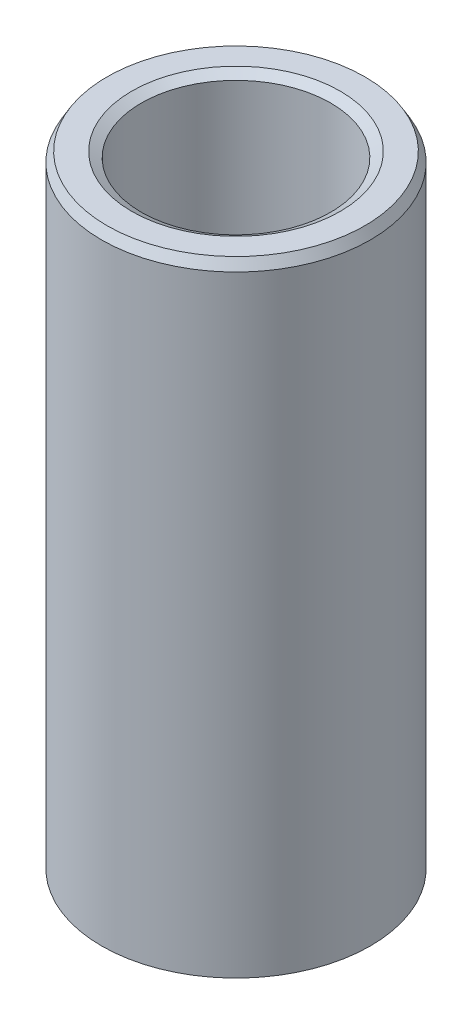
ISO-10303-21;
HEADER;
FILE_DESCRIPTION(('STEP AP214'),'2;1');
FILE_NAME('part.step','',(''),(''),'','','');
FILE_SCHEMA(('AUTOMOTIVE_DESIGN { 1 0 10303 214 1 1 1 1 }'));
ENDSEC;
DATA;
#1=APPLICATION_CONTEXT('core data for automotive mechanical design processes');
#2=APPLICATION_PROTOCOL_DEFINITION('international standard','automotive_design',2000,#1);
#3=PRODUCT_CONTEXT('',#1,'mechanical');
#4=PRODUCT('Part','Part','',(#3));
#5=PRODUCT_RELATED_PRODUCT_CATEGORY('part','',(#4));
#6=PRODUCT_DEFINITION_FORMATION('','',#4);
#7=PRODUCT_DEFINITION_CONTEXT('part definition',#1,'design');
#8=PRODUCT_DEFINITION('design','',#6,#7);
#9=PRODUCT_DEFINITION_SHAPE('','',#8);
#10=(LENGTH_UNIT() NAMED_UNIT(*) SI_UNIT(.MILLI.,.METRE.));
#11=(NAMED_UNIT(*) PLANE_ANGLE_UNIT() SI_UNIT($,.RADIAN.));
#12=(NAMED_UNIT(*) SI_UNIT($,.STERADIAN.) SOLID_ANGLE_UNIT());
#13=UNCERTAINTY_MEASURE_WITH_UNIT(LENGTH_MEASURE(1.E-05),#10,'distance_accuracy_value','');
#14=(GEOMETRIC_REPRESENTATION_CONTEXT(3) GLOBAL_UNCERTAINTY_ASSIGNED_CONTEXT((#13)) GLOBAL_UNIT_ASSIGNED_CONTEXT((#10,
#11,#12)) REPRESENTATION_CONTEXT('',''));
#15=CARTESIAN_POINT('',(0.,0.,0.));
#16=DIRECTION('',(0.,0.,1.));
#17=DIRECTION('',(1.,0.,0.));
#18=AXIS2_PLACEMENT_3D('',#15,#16,#17);
#19=CARTESIAN_POINT('',(0.,244.614480406937,0.));
#20=DIRECTION('',(0.,-1.,0.));
#21=DIRECTION('',(0.,0.,-1.));
#22=AXIS2_PLACEMENT_3D('',#19,#20,#21);
#23=CYLINDRICAL_SURFACE('',#22,52.5);
#24=CARTESIAN_POINT('',(0.,2.15111233100546,0.));
#25=DIRECTION('',(0.,1.,0.));
#26=DIRECTION('',(0.,0.,1.));
#27=AXIS2_PLACEMENT_3D('',#24,#25,#26);
#28=CIRCLE('',#27,52.5);
#29=CARTESIAN_POINT('',(0.,2.15111233100543,-52.5));
#30=VERTEX_POINT('',#29);
#31=EDGE_CURVE('E10',#30,#30,#28,.T.);
#32=CARTESIAN_POINT('',(0.,240.888644556848,0.));
#33=DIRECTION('',(0.,1.,0.));
#34=DIRECTION('',(0.,0.,1.));
#35=AXIS2_PLACEMENT_3D('',#32,#33,#34);
#36=CIRCLE('',#35,52.5);
#37=CARTESIAN_POINT('',(0.,240.888644556848,-52.5));
#38=VERTEX_POINT('',#37);
#39=EDGE_CURVE('E50',#38,#38,#36,.F.);
#40=CARTESIAN_POINT('',(0.,2.15111233100543,-52.5));
#41=CARTESIAN_POINT('',(0.,4.63796162502462,-52.5));
#42=CARTESIAN_POINT('',(0.,7.12481091904381,-52.5));
#43=CARTESIAN_POINT('',(0.,12.0985095070822,-52.5));
#44=CARTESIAN_POINT('',(0.,14.5853588011014,-52.5));
#45=CARTESIAN_POINT('',(0.,19.5590573891398,-52.5));
#46=CARTESIAN_POINT('',(0.,22.045906683159,-52.5));
#47=CARTESIAN_POINT('',(0.,27.0196052711974,-52.5));
#48=CARTESIAN_POINT('',(0.,29.5064545652165,-52.5));
#49=CARTESIAN_POINT('',(0.,34.4801531532549,-52.5));
#50=CARTESIAN_POINT('',(0.,36.9670024472741,-52.5));
#51=CARTESIAN_POINT('',(0.,41.9407010353125,-52.5));
#52=CARTESIAN_POINT('',(0.,44.4275503293317,-52.5));
#53=CARTESIAN_POINT('',(0.,49.4012489173701,-52.5));
#54=CARTESIAN_POINT('',(0.,51.8880982113893,-52.5));
#55=CARTESIAN_POINT('',(0.,56.8617967994277,-52.5));
#56=CARTESIAN_POINT('',(0.,59.3486460934469,-52.5));
#57=CARTESIAN_POINT('',(0.,64.3223446814852,-52.5));
#58=CARTESIAN_POINT('',(0.,66.8091939755044,-52.5));
#59=CARTESIAN_POINT('',(0.,71.7828925635428,-52.5));
#60=CARTESIAN_POINT('',(0.,74.269741857562,-52.5));
#61=CARTESIAN_POINT('',(0.,79.2434404456004,-52.5));
#62=CARTESIAN_POINT('',(0.,81.7302897396196,-52.5));
#63=CARTESIAN_POINT('',(0.,86.703988327658,-52.5));
#64=CARTESIAN_POINT('',(0.,89.1908376216772,-52.5));
#65=CARTESIAN_POINT('',(0.,94.1645362097156,-52.5));
#66=CARTESIAN_POINT('',(0.,96.6513855037348,-52.5));
#67=CARTESIAN_POINT('',(0.,101.625084091773,-52.5));
#68=CARTESIAN_POINT('',(0.,104.111933385792,-52.5));
#69=CARTESIAN_POINT('',(0.,109.085631973831,-52.5));
#70=CARTESIAN_POINT('',(0.,111.57248126785,-52.5));
#71=CARTESIAN_POINT('',(0.,116.546179855888,-52.5));
#72=CARTESIAN_POINT('',(0.,119.033029149908,-52.5));
#73=CARTESIAN_POINT('',(0.,124.006727737946,-52.5));
#74=CARTESIAN_POINT('',(0.,126.493577031965,-52.5));
#75=CARTESIAN_POINT('',(0.,131.467275620003,-52.5));
#76=CARTESIAN_POINT('',(0.,133.954124914023,-52.5));
#77=CARTESIAN_POINT('',(0.,138.927823502061,-52.5));
#78=CARTESIAN_POINT('',(0.,141.41467279608,-52.5));
#79=CARTESIAN_POINT('',(0.,146.388371384119,-52.5));
#80=CARTESIAN_POINT('',(0.,148.875220678138,-52.5));
#81=CARTESIAN_POINT('',(0.,153.848919266176,-52.5));
#82=CARTESIAN_POINT('',(0.,156.335768560195,-52.5));
#83=CARTESIAN_POINT('',(0.,161.309467148234,-52.5));
#84=CARTESIAN_POINT('',(0.,163.796316442253,-52.5));
#85=CARTESIAN_POINT('',(0.,168.770015030291,-52.5));
#86=CARTESIAN_POINT('',(0.,171.256864324311,-52.5));
#87=CARTESIAN_POINT('',(0.,176.230562912349,-52.5));
#88=CARTESIAN_POINT('',(0.,178.717412206368,-52.5));
#89=CARTESIAN_POINT('',(0.,183.691110794407,-52.5));
#90=CARTESIAN_POINT('',(0.,186.177960088426,-52.5));
#91=CARTESIAN_POINT('',(0.,191.151658676464,-52.5));
#92=CARTESIAN_POINT('',(0.,193.638507970483,-52.5));
#93=CARTESIAN_POINT('',(0.,198.612206558522,-52.5));
#94=CARTESIAN_POINT('',(0.,201.099055852541,-52.5));
#95=CARTESIAN_POINT('',(0.,206.072754440579,-52.5));
#96=CARTESIAN_POINT('',(0.,208.559603734598,-52.5));
#97=CARTESIAN_POINT('',(0.,213.533302322637,-52.5));
#98=CARTESIAN_POINT('',(0.,216.020151616656,-52.5));
#99=CARTESIAN_POINT('',(0.,220.993850204694,-52.5));
#100=CARTESIAN_POINT('',(0.,223.480699498714,-52.5));
#101=CARTESIAN_POINT('',(0.,228.454398086752,-52.5));
#102=CARTESIAN_POINT('',(0.,230.941247380771,-52.5));
#103=CARTESIAN_POINT('',(0.,235.91494596881,-52.5));
#104=CARTESIAN_POINT('',(0.,238.401795262829,-52.5));
#105=CARTESIAN_POINT('',(0.,240.888644556848,-52.5));
#106=B_SPLINE_CURVE_WITH_KNOTS('',3,(#40,#41,#42,#43,#44,#45,#46,#47,#48,#49,#50,#51,#52,#53,
#54,#55,#56,#57,#58,#59,#60,#61,#62,#63,#64,#65,#66,#67,#68,#69,#70,#71,#72,#73,#74,#75,#76,#77,
#78,#79,#80,#81,#82,#83,#84,#85,#86,#87,#88,#89,#90,#91,#92,#93,#94,#95,#96,#97,#98,#99,#100,
#101,#102,#103,#104,#105),.UNSPECIFIED.,.F.,.F.,(4,2,2,2,2,2,2,2,2,2,2,2,2,2,2,2,2,2,2,2,2,2,2,
2,2,2,2,2,2,2,2,2,4),(0.,7.46054788205758,14.9210957641152,22.3816436461727,29.8421915282303,
37.3027394102879,44.7632872923455,52.223835174403,59.6843830564606,67.1449309385182,
74.6054788205758,82.0660267026334,89.526574584691,96.9871224667485,104.447670348806,
111.908218230864,119.368766112921,126.829313994979,134.289861877036,141.750409759094,
149.210957641152,156.671505523209,164.132053405267,171.592601287324,179.053149169382,
186.513697051439,193.974244933497,201.434792815555,208.895340697612,216.35588857967,
223.816436461727,231.276984343785,238.737532225843),.UNSPECIFIED.);
#107=EDGE_CURVE('BSEAM39',#30,#38,#106,.T.);
#108=ORIENTED_EDGE('',*,*,#31,.T.);
#109=ORIENTED_EDGE('',*,*,#39,.T.);
#110=ORIENTED_EDGE('',*,*,#107,.T.);
#111=ORIENTED_EDGE('',*,*,#107,.F.);
#112=EDGE_LOOP('',(#108,#110,#109,#111));
#113=FACE_BOUND('',#112,.T.);
#114=ADVANCED_FACE('F39',(#113),#23,.T.);
#115=CARTESIAN_POINT('',(0.,244.614480406937,0.));
#116=DIRECTION('',(0.,1.,0.));
#117=DIRECTION('',(0.,0.,1.));
#118=AXIS2_PLACEMENT_3D('',#115,#116,#117);
#119=PLANE('',#118);
#120=CARTESIAN_POINT('',(0.,244.614480406937,0.));
#121=DIRECTION('',(0.,1.,0.));
#122=DIRECTION('',(0.,0.,1.));
#123=AXIS2_PLACEMENT_3D('',#120,#121,#122);
#124=CIRCLE('',#123,40.6925283340652);
#125=CARTESIAN_POINT('',(0.,244.614480406937,40.6925283340652));
#126=VERTEX_POINT('',#125);
#127=EDGE_CURVE('E58',#126,#126,#124,.F.);
#128=ORIENTED_EDGE('',*,*,#127,.T.);
#129=EDGE_LOOP('',(#128));
#130=FACE_BOUND('',#129,.T.);
#131=CARTESIAN_POINT('',(0.,244.614480406937,0.));
#132=DIRECTION('',(0.,1.,0.));
#133=DIRECTION('',(0.,0.,1.));
#134=AXIS2_PLACEMENT_3D('',#131,#132,#133);
#135=CIRCLE('',#134,50.3488876689948);
#136=CARTESIAN_POINT('',(0.,244.614480406937,50.3488876689948));
#137=VERTEX_POINT('',#136);
#138=EDGE_CURVE('E61',#137,#137,#135,.T.);
#139=ORIENTED_EDGE('',*,*,#138,.T.);
#140=EDGE_LOOP('',(#139));
#141=FACE_BOUND('',#140,.T.);
#142=ADVANCED_FACE('F88',(#130,#141),#119,.T.);
#143=CARTESIAN_POINT('',(0.,0.,0.));
#144=DIRECTION('',(0.,1.,0.));
#145=DIRECTION('',(0.,0.,1.));
#146=AXIS2_PLACEMENT_3D('',#143,#144,#145);
#147=PLANE('',#146);
#148=CARTESIAN_POINT('',(0.,0.,0.));
#149=DIRECTION('',(0.,1.,0.));
#150=DIRECTION('',(0.,0.,1.));
#151=AXIS2_PLACEMENT_3D('',#148,#149,#150);
#152=CIRCLE('',#151,39.1178048149811);
#153=CARTESIAN_POINT('',(0.,0.,39.1178048149811));
#154=VERTEX_POINT('',#153);
#155=EDGE_CURVE('E51',#154,#154,#152,.T.);
#156=ORIENTED_EDGE('',*,*,#155,.T.);
#157=EDGE_LOOP('',(#156));
#158=FACE_BOUND('',#157,.T.);
#159=CARTESIAN_POINT('',(0.,0.,0.));
#160=DIRECTION('',(0.,1.,0.));
#161=DIRECTION('',(0.,0.,1.));
#162=AXIS2_PLACEMENT_3D('',#159,#160,#161);
#163=CIRCLE('',#162,48.7741641499106);
#164=CARTESIAN_POINT('',(0.,0.,48.7741641499106));
#165=VERTEX_POINT('',#164);
#166=EDGE_CURVE('E54',#165,#165,#163,.F.);
#167=ORIENTED_EDGE('',*,*,#166,.T.);
#168=EDGE_LOOP('',(#167));
#169=FACE_BOUND('',#168,.T.);
#170=ADVANCED_FACE('F83',(#158,#169),#147,.F.);
#171=CARTESIAN_POINT('',(0.,244.614480406937,0.));
#172=DIRECTION('',(0.,-1.,0.));
#173=DIRECTION('',(0.,0.,-1.));
#174=AXIS2_PLACEMENT_3D('',#171,#172,#173);
#175=CYLINDRICAL_SURFACE('',#174,36.9666924839757);
#176=CARTESIAN_POINT('',(0.,242.463368075931,0.));
#177=DIRECTION('',(0.,1.,0.));
#178=DIRECTION('',(0.,0.,1.));
#179=AXIS2_PLACEMENT_3D('',#176,#177,#178);
#180=CIRCLE('',#179,36.9666924839757);
#181=CARTESIAN_POINT('',(0.,242.463368075931,-36.9666924839757));
#182=VERTEX_POINT('',#181);
#183=EDGE_CURVE('E67',#182,#182,#180,.T.);
#184=CARTESIAN_POINT('',(0.,3.72583585008934,0.));
#185=DIRECTION('',(0.,1.,0.));
#186=DIRECTION('',(0.,0.,1.));
#187=AXIS2_PLACEMENT_3D('',#184,#185,#186);
#188=CIRCLE('',#187,36.9666924839757);
#189=CARTESIAN_POINT('',(0.,3.72583585008932,-36.9666924839757));
#190=VERTEX_POINT('',#189);
#191=EDGE_CURVE('E69',#190,#190,#188,.F.);
#192=CARTESIAN_POINT('',(0.,242.463368075931,-36.9666924839757));
#193=CARTESIAN_POINT('',(0.,239.976518781912,-36.9666924839757));
#194=CARTESIAN_POINT('',(0.,237.489669487893,-36.9666924839757));
#195=CARTESIAN_POINT('',(0.,232.515970899855,-36.9666924839757));
#196=CARTESIAN_POINT('',(0.,230.029121605835,-36.9666924839757));
#197=CARTESIAN_POINT('',(0.,225.055423017797,-36.9666924839757));
#198=CARTESIAN_POINT('',(0.,222.568573723778,-36.9666924839757));
#199=CARTESIAN_POINT('',(0.,217.594875135739,-36.9666924839757));
#200=CARTESIAN_POINT('',(0.,215.10802584172,-36.9666924839757));
#201=CARTESIAN_POINT('',(0.,210.134327253682,-36.9666924839757));
#202=CARTESIAN_POINT('',(0.,207.647477959663,-36.9666924839757));
#203=CARTESIAN_POINT('',(0.,202.673779371624,-36.9666924839757));
#204=CARTESIAN_POINT('',(0.,200.186930077605,-36.9666924839757));
#205=CARTESIAN_POINT('',(0.,195.213231489567,-36.9666924839757));
#206=CARTESIAN_POINT('',(0.,192.726382195548,-36.9666924839757));
#207=CARTESIAN_POINT('',(0.,187.752683607509,-36.9666924839757));
#208=CARTESIAN_POINT('',(0.,185.26583431349,-36.9666924839757));
#209=CARTESIAN_POINT('',(0.,180.292135725452,-36.9666924839757));
#210=CARTESIAN_POINT('',(0.,177.805286431432,-36.9666924839757));
#211=CARTESIAN_POINT('',(0.,172.831587843394,-36.9666924839757));
#212=CARTESIAN_POINT('',(0.,170.344738549375,-36.9666924839757));
#213=CARTESIAN_POINT('',(0.,165.371039961337,-36.9666924839757));
#214=CARTESIAN_POINT('',(0.,162.884190667317,-36.9666924839757));
#215=CARTESIAN_POINT('',(0.,157.910492079279,-36.9666924839757));
#216=CARTESIAN_POINT('',(0.,155.42364278526,-36.9666924839757));
#217=CARTESIAN_POINT('',(0.,150.449944197221,-36.9666924839757));
#218=CARTESIAN_POINT('',(0.,147.963094903202,-36.9666924839757));
#219=CARTESIAN_POINT('',(0.,142.989396315164,-36.9666924839757));
#220=CARTESIAN_POINT('',(0.,140.502547021145,-36.9666924839757));
#221=CARTESIAN_POINT('',(0.,135.528848433106,-36.9666924839757));
#222=CARTESIAN_POINT('',(0.,133.041999139087,-36.9666924839757));
#223=CARTESIAN_POINT('',(0.,128.068300551049,-36.9666924839757));
#224=CARTESIAN_POINT('',(0.,125.58145125703,-36.9666924839757));
#225=CARTESIAN_POINT('',(0.,120.607752668991,-36.9666924839757));
#226=CARTESIAN_POINT('',(0.,118.120903374972,-36.9666924839757));
#227=CARTESIAN_POINT('',(0.,113.147204786934,-36.9666924839757));
#228=CARTESIAN_POINT('',(0.,110.660355492914,-36.9666924839757));
#229=CARTESIAN_POINT('',(0.,105.686656904876,-36.9666924839757));
#230=CARTESIAN_POINT('',(0.,103.199807610857,-36.9666924839757));
#231=CARTESIAN_POINT('',(0.,98.2261090228185,-36.9666924839757));
#232=CARTESIAN_POINT('',(0.,95.7392597287993,-36.9666924839757));
#233=CARTESIAN_POINT('',(0.,90.7655611407609,-36.9666924839757));
#234=CARTESIAN_POINT('',(0.,88.2787118467417,-36.9666924839757));
#235=CARTESIAN_POINT('',(0.,83.3050132587033,-36.9666924839757));
#236=CARTESIAN_POINT('',(0.,80.8181639646841,-36.9666924839757));
#237=CARTESIAN_POINT('',(0.,75.8444653766458,-36.9666924839757));
#238=CARTESIAN_POINT('',(0.,73.3576160826266,-36.9666924839757));
#239=CARTESIAN_POINT('',(0.,68.3839174945882,-36.9666924839757));
#240=CARTESIAN_POINT('',(0.,65.897068200569,-36.9666924839757));
#241=CARTESIAN_POINT('',(0.,60.9233696125306,-36.9666924839757));
#242=CARTESIAN_POINT('',(0.,58.4365203185114,-36.9666924839757));
#243=CARTESIAN_POINT('',(0.,53.4628217304731,-36.9666924839757));
#244=CARTESIAN_POINT('',(0.,50.9759724364539,-36.9666924839757));
#245=CARTESIAN_POINT('',(0.,46.0022738484155,-36.9666924839757));
#246=CARTESIAN_POINT('',(0.,43.5154245543963,-36.9666924839757));
#247=CARTESIAN_POINT('',(0.,38.541725966358,-36.9666924839757));
#248=CARTESIAN_POINT('',(0.,36.0548766723388,-36.9666924839757));
#249=CARTESIAN_POINT('',(0.,31.0811780843004,-36.9666924839757));
#250=CARTESIAN_POINT('',(0.,28.5943287902812,-36.9666924839757));
#251=CARTESIAN_POINT('',(0.,23.6206302022428,-36.9666924839757));
#252=CARTESIAN_POINT('',(0.,21.1337809082236,-36.9666924839757));
#253=CARTESIAN_POINT('',(0.,16.1600823201853,-36.9666924839757));
#254=CARTESIAN_POINT('',(0.,13.6732330261661,-36.9666924839757));
#255=CARTESIAN_POINT('',(0.,8.6995344381277,-36.9666924839757));
#256=CARTESIAN_POINT('',(0.,6.21268514410851,-36.9666924839757));
#257=CARTESIAN_POINT('',(0.,3.72583585008932,-36.9666924839757));
#258=B_SPLINE_CURVE_WITH_KNOTS('',3,(#192,#193,#194,#195,#196,#197,#198,#199,#200,#201,#202,
#203,#204,#205,#206,#207,#208,#209,#210,#211,#212,#213,#214,#215,#216,#217,#218,#219,#220,#221,
#222,#223,#224,#225,#226,#227,#228,#229,#230,#231,#232,#233,#234,#235,#236,#237,#238,#239,#240,
#241,#242,#243,#244,#245,#246,#247,#248,#249,#250,#251,#252,#253,#254,#255,#256,#257),
.UNSPECIFIED.,.F.,.F.,(4,2,2,2,2,2,2,2,2,2,2,2,2,2,2,2,2,2,2,2,2,2,2,2,2,2,2,2,2,2,2,2,4),(0.,
7.46054788205758,14.9210957641151,22.3816436461727,29.8421915282303,37.3027394102878,
44.7632872923454,52.223835174403,59.6843830564605,67.1449309385181,74.6054788205756,
82.0660267026332,89.5265745846908,96.9871224667483,104.447670348806,111.908218230863,
119.368766112921,126.829313994979,134.289861877036,141.750409759094,149.210957641151,
156.671505523209,164.132053405266,171.592601287324,179.053149169382,186.513697051439,
193.974244933497,201.434792815554,208.895340697612,216.355888579669,223.816436461727,
231.276984343784,238.737532225842),.UNSPECIFIED.);
#259=EDGE_CURVE('BSEAM71',#182,#190,#258,.T.);
#260=ORIENTED_EDGE('',*,*,#183,.T.);
#261=ORIENTED_EDGE('',*,*,#191,.T.);
#262=ORIENTED_EDGE('',*,*,#259,.T.);
#263=ORIENTED_EDGE('',*,*,#259,.F.);
#264=EDGE_LOOP('',(#260,#262,#261,#263));
#265=FACE_BOUND('',#264,.T.);
#266=ADVANCED_FACE('F71',(#265),#175,.F.);
#267=CARTESIAN_POINT('',(0.,242.463368075931,0.));
#268=DIRECTION('',(0.,1.,0.));
#269=DIRECTION('',(0.,0.,1.));
#270=AXIS2_PLACEMENT_3D('',#267,#268,#269);
#271=CONICAL_SURFACE('',#270,36.9666924839757,1.0471975511966);
#272=ORIENTED_EDGE('',*,*,#127,.F.);
#273=EDGE_LOOP('',(#272));
#274=FACE_BOUND('',#273,.T.);
#275=ORIENTED_EDGE('',*,*,#183,.F.);
#276=EDGE_LOOP('',(#275));
#277=FACE_BOUND('',#276,.T.);
#278=ADVANCED_FACE('F77',(#274,#277),#271,.F.);
#279=CARTESIAN_POINT('',(0.,0.,0.));
#280=DIRECTION('',(0.,-1.,0.));
#281=DIRECTION('',(0.,0.,-1.));
#282=AXIS2_PLACEMENT_3D('',#279,#280,#281);
#283=CONICAL_SURFACE('',#282,39.1178048149811,0.523598775598292);
#284=ORIENTED_EDGE('',*,*,#191,.F.);
#285=EDGE_LOOP('',(#284));
#286=FACE_BOUND('',#285,.T.);
#287=ORIENTED_EDGE('',*,*,#155,.F.);
#288=EDGE_LOOP('',(#287));
#289=FACE_BOUND('',#288,.T.);
#290=ADVANCED_FACE('F73',(#286,#289),#283,.F.);
#291=CARTESIAN_POINT('',(0.,2.15111233100546,0.));
#292=DIRECTION('',(0.,1.,0.));
#293=DIRECTION('',(0.,0.,1.));
#294=AXIS2_PLACEMENT_3D('',#291,#292,#293);
#295=CONICAL_SURFACE('',#294,52.5,1.04719755119661);
#296=ORIENTED_EDGE('',*,*,#166,.F.);
#297=EDGE_LOOP('',(#296));
#298=FACE_BOUND('',#297,.T.);
#299=ORIENTED_EDGE('',*,*,#31,.F.);
#300=EDGE_LOOP('',(#299));
#301=FACE_BOUND('',#300,.T.);
#302=ADVANCED_FACE('F76',(#298,#301),#295,.T.);
#303=CARTESIAN_POINT('',(0.,244.614480406937,0.));
#304=DIRECTION('',(0.,-1.,0.));
#305=DIRECTION('',(0.,0.,-1.));
#306=AXIS2_PLACEMENT_3D('',#303,#304,#305);
#307=CONICAL_SURFACE('',#306,50.3488876689948,0.523598775598296);
#308=ORIENTED_EDGE('',*,*,#39,.F.);
#309=EDGE_LOOP('',(#308));
#310=FACE_BOUND('',#309,.T.);
#311=ORIENTED_EDGE('',*,*,#138,.F.);
#312=EDGE_LOOP('',(#311));
#313=FACE_BOUND('',#312,.T.);
#314=ADVANCED_FACE('F45',(#310,#313),#307,.T.);
#315=CLOSED_SHELL('',(#114,#142,#170,#266,#278,#290,#302,#314));
#316=MANIFOLD_SOLID_BREP('B2',#315);
#317=ADVANCED_BREP_SHAPE_REPRESENTATION('',(#18,#316),#14);
#318=SHAPE_DEFINITION_REPRESENTATION(#9,#317);
ENDSEC;
END-ISO-10303-21;
